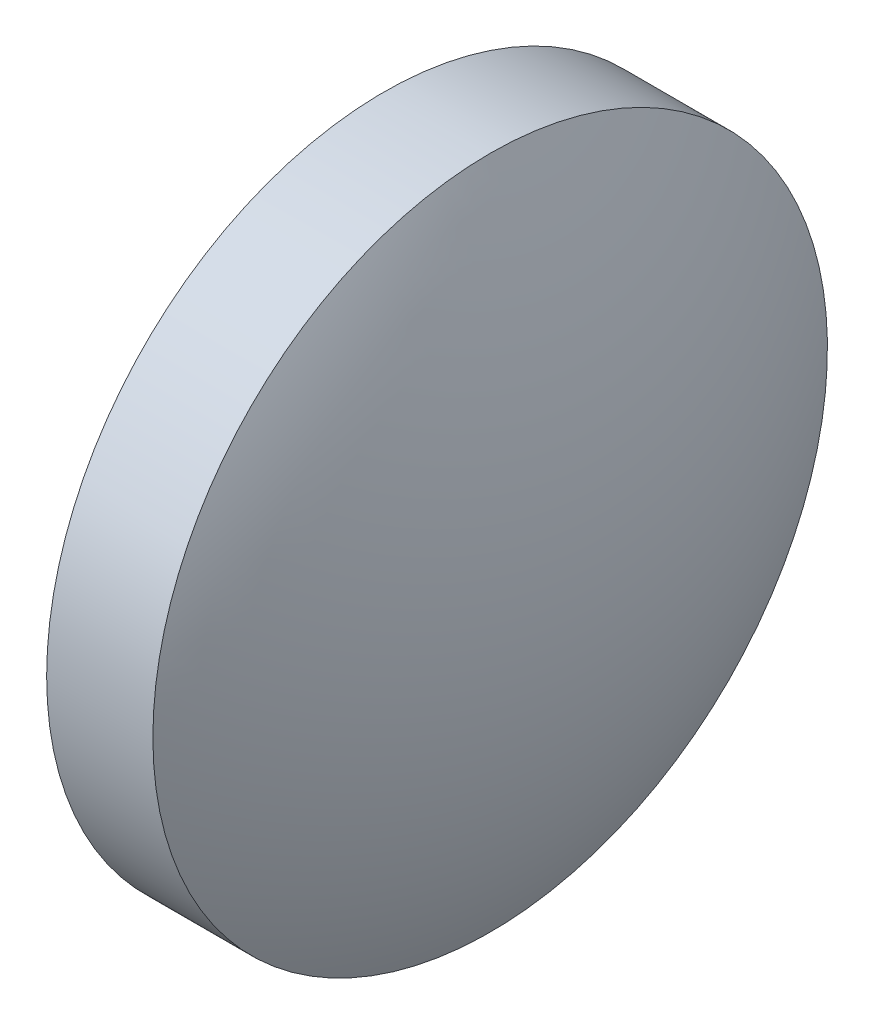
ISO-10303-21;
HEADER;
FILE_DESCRIPTION(('STEP AP214'),'2;1');
FILE_NAME('part.step','',(''),(''),'','','');
FILE_SCHEMA(('AUTOMOTIVE_DESIGN { 1 0 10303 214 1 1 1 1 }'));
ENDSEC;
DATA;
#1=APPLICATION_CONTEXT('core data for automotive mechanical design processes');
#2=APPLICATION_PROTOCOL_DEFINITION('international standard','automotive_design',2000,#1);
#3=PRODUCT_CONTEXT('',#1,'mechanical');
#4=PRODUCT('Part','Part','',(#3));
#5=PRODUCT_RELATED_PRODUCT_CATEGORY('part','',(#4));
#6=PRODUCT_DEFINITION_FORMATION('','',#4);
#7=PRODUCT_DEFINITION_CONTEXT('part definition',#1,'design');
#8=PRODUCT_DEFINITION('design','',#6,#7);
#9=PRODUCT_DEFINITION_SHAPE('','',#8);
#10=(LENGTH_UNIT() NAMED_UNIT(*) SI_UNIT(.MILLI.,.METRE.));
#11=(NAMED_UNIT(*) PLANE_ANGLE_UNIT() SI_UNIT($,.RADIAN.));
#12=(NAMED_UNIT(*) SI_UNIT($,.STERADIAN.) SOLID_ANGLE_UNIT());
#13=UNCERTAINTY_MEASURE_WITH_UNIT(LENGTH_MEASURE(1.E-05),#10,'distance_accuracy_value','');
#14=(GEOMETRIC_REPRESENTATION_CONTEXT(3) GLOBAL_UNCERTAINTY_ASSIGNED_CONTEXT((#13)) GLOBAL_UNIT_ASSIGNED_CONTEXT((#10,
#11,#12)) REPRESENTATION_CONTEXT('',''));
#15=CARTESIAN_POINT('',(0.,0.,0.));
#16=DIRECTION('',(0.,0.,1.));
#17=DIRECTION('',(1.,0.,0.));
#18=AXIS2_PLACEMENT_3D('',#15,#16,#17);
#19=CARTESIAN_POINT('',(357.065415394147,34.69530442998,0.));
#20=DIRECTION('',(-1.,0.,0.));
#21=DIRECTION('',(0.,1.,0.));
#22=AXIS2_PLACEMENT_3D('',#19,#20,#21);
#23=SPHERICAL_SURFACE('',#22,13.7038782051283);
#24=CARTESIAN_POINT('',(369.209293599275,34.69530442998,0.));
#25=DIRECTION('',(-1.,0.,0.));
#26=DIRECTION('',(0.,0.,1.));
#27=AXIS2_PLACEMENT_3D('',#24,#25,#26);
#28=CIRCLE('',#27,6.35);
#29=CARTESIAN_POINT('',(369.209293599275,34.69530442998,6.35));
#30=VERTEX_POINT('',#29);
#31=EDGE_CURVE('E10',#30,#30,#28,.T.);
#32=ORIENTED_EDGE('',*,*,#31,.F.);
#33=EDGE_LOOP('',(#32));
#34=FACE_BOUND('',#33,.T.);
#35=ADVANCED_FACE('F35',(#34),#23,.T.);
#36=CARTESIAN_POINT('',(364.881265109281,34.69530442998,0.));
#37=DIRECTION('',(-1.,0.,0.));
#38=DIRECTION('',(0.,0.,1.));
#39=AXIS2_PLACEMENT_3D('',#36,#37,#38);
#40=CYLINDRICAL_SURFACE('',#39,6.35);
#41=CARTESIAN_POINT('',(367.209293599275,34.69530442998,0.));
#42=DIRECTION('',(-1.,0.,0.));
#43=DIRECTION('',(0.,0.,1.));
#44=AXIS2_PLACEMENT_3D('',#41,#42,#43);
#45=CIRCLE('',#44,6.35);
#46=CARTESIAN_POINT('',(367.209293599275,34.69530442998,6.35));
#47=VERTEX_POINT('',#46);
#48=EDGE_CURVE('E41',#47,#47,#45,.T.);
#49=ORIENTED_EDGE('',*,*,#48,.F.);
#50=EDGE_LOOP('',(#49));
#51=FACE_BOUND('',#50,.T.);
#52=ORIENTED_EDGE('',*,*,#31,.T.);
#53=EDGE_LOOP('',(#52));
#54=FACE_BOUND('',#53,.T.);
#55=ADVANCED_FACE('F49',(#51,#54),#40,.T.);
#56=CARTESIAN_POINT('',(367.209293599275,34.69530442998,0.));
#57=DIRECTION('',(1.,0.,0.));
#58=DIRECTION('',(0.,0.,-1.));
#59=AXIS2_PLACEMENT_3D('',#56,#57,#58);
#60=PLANE('',#59);
#61=ORIENTED_EDGE('',*,*,#48,.T.);
#62=EDGE_LOOP('',(#61));
#63=FACE_BOUND('',#62,.T.);
#64=ADVANCED_FACE('F47',(#63),#60,.F.);
#65=CLOSED_SHELL('',(#35,#55,#64));
#66=MANIFOLD_SOLID_BREP('B2',#65);
#67=ADVANCED_BREP_SHAPE_REPRESENTATION('',(#18,#66),#14);
#68=SHAPE_DEFINITION_REPRESENTATION(#9,#67);
ENDSEC;
END-ISO-10303-21;
